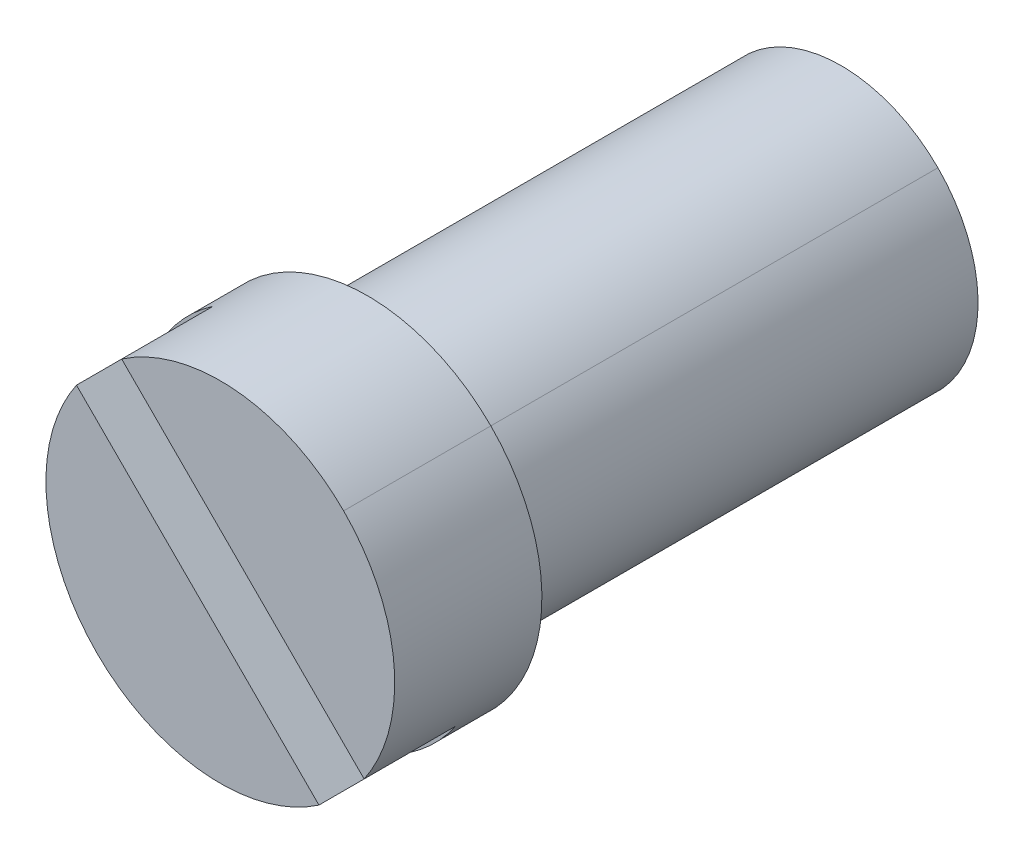
ISO-10303-21;
HEADER;
FILE_DESCRIPTION(('STEP AP214'),'2;1');
FILE_NAME('part.step','',(''),(''),'','','');
FILE_SCHEMA(('AUTOMOTIVE_DESIGN { 1 0 10303 214 1 1 1 1 }'));
ENDSEC;
DATA;
#1=APPLICATION_CONTEXT('core data for automotive mechanical design processes');
#2=APPLICATION_PROTOCOL_DEFINITION('international standard','automotive_design',2000,#1);
#3=PRODUCT_CONTEXT('',#1,'mechanical');
#4=PRODUCT('Part','Part','',(#3));
#5=PRODUCT_RELATED_PRODUCT_CATEGORY('part','',(#4));
#6=PRODUCT_DEFINITION_FORMATION('','',#4);
#7=PRODUCT_DEFINITION_CONTEXT('part definition',#1,'design');
#8=PRODUCT_DEFINITION('design','',#6,#7);
#9=PRODUCT_DEFINITION_SHAPE('','',#8);
#10=(LENGTH_UNIT() NAMED_UNIT(*) SI_UNIT(.MILLI.,.METRE.));
#11=(NAMED_UNIT(*) PLANE_ANGLE_UNIT() SI_UNIT($,.RADIAN.));
#12=(NAMED_UNIT(*) SI_UNIT($,.STERADIAN.) SOLID_ANGLE_UNIT());
#13=UNCERTAINTY_MEASURE_WITH_UNIT(LENGTH_MEASURE(1.E-05),#10,'distance_accuracy_value','');
#14=(GEOMETRIC_REPRESENTATION_CONTEXT(3) GLOBAL_UNCERTAINTY_ASSIGNED_CONTEXT((#13)) GLOBAL_UNIT_ASSIGNED_CONTEXT((#10,
#11,#12)) REPRESENTATION_CONTEXT('',''));
#15=CARTESIAN_POINT('',(0.,0.,0.));
#16=DIRECTION('',(0.,0.,1.));
#17=DIRECTION('',(1.,0.,0.));
#18=AXIS2_PLACEMENT_3D('',#15,#16,#17);
#19=CARTESIAN_POINT('',(12.700343805971,5.27034380597093,8.76943375672969));
#20=DIRECTION('',(0.,0.,1.));
#21=DIRECTION('',(0.707106781186547,0.707106781186548,0.));
#22=AXIS2_PLACEMENT_3D('',#19,#20,#21);
#23=CYLINDRICAL_SURFACE('',#22,1.5);
#24=DIRECTION('',(0.,0.,-1.));
#25=VECTOR('',#24,1.);
#26=CARTESIAN_POINT('',(13.7610039777508,6.33100397775075,8.76943375672969));
#27=LINE('',#26,#25);
#28=CARTESIAN_POINT('',(13.7610039777508,6.33100397775075,12.0176388374866));
#29=VERTEX_POINT('',#28);
#30=CARTESIAN_POINT('',(13.7610039777508,6.33100397775075,6.83));
#31=VERTEX_POINT('',#30);
#32=EDGE_CURVE('E28',#29,#31,#27,.T.);
#33=ORIENTED_EDGE('',*,*,#32,.F.);
#34=CARTESIAN_POINT('',(12.700343805971,5.27034380597093,12.0176388374866));
#35=DIRECTION('',(0.,0.,-1.));
#36=DIRECTION('',(0.707106781186547,0.707106781186548,0.));
#37=AXIS2_PLACEMENT_3D('',#34,#35,#36);
#38=CIRCLE('',#37,1.5);
#39=CARTESIAN_POINT('',(11.6396836341912,4.20968363419111,12.0176388374866));
#40=VERTEX_POINT('',#39);
#41=EDGE_CURVE('E175',#29,#40,#38,.T.);
#42=ORIENTED_EDGE('',*,*,#41,.T.);
#43=DIRECTION('',(0.,0.,-1.));
#44=VECTOR('',#43,1.);
#45=CARTESIAN_POINT('',(11.6396836341912,4.20968363419111,8.76943375672969));
#46=LINE('',#45,#44);
#47=CARTESIAN_POINT('',(11.6396836341912,4.20968363419111,6.83));
#48=VERTEX_POINT('',#47);
#49=EDGE_CURVE('E157',#40,#48,#46,.T.);
#50=ORIENTED_EDGE('',*,*,#49,.T.);
#51=CARTESIAN_POINT('',(12.700343805971,5.27034380597093,6.83));
#52=DIRECTION('',(0.,0.,-1.));
#53=DIRECTION('',(0.707106781186547,0.707106781186548,0.));
#54=AXIS2_PLACEMENT_3D('',#51,#52,#53);
#55=CIRCLE('',#54,1.5);
#56=EDGE_CURVE('E153',#31,#48,#55,.T.);
#57=ORIENTED_EDGE('',*,*,#56,.F.);
#58=EDGE_LOOP('',(#33,#42,#50,#57));
#59=FACE_BOUND('',#58,.T.);
#60=ADVANCED_FACE('F17',(#59),#23,.T.);
#61=CARTESIAN_POINT('',(12.700343805971,5.27034380597093,12.8238194187433));
#62=DIRECTION('',(0.,0.,-1.));
#63=DIRECTION('',(0.707106781186545,0.70710678118655,0.));
#64=AXIS2_PLACEMENT_3D('',#61,#62,#63);
#65=CYLINDRICAL_SURFACE('',#64,1.91034380597093);
#66=DIRECTION('',(0.,0.,1.));
#67=VECTOR('',#66,1.);
#68=CARTESIAN_POINT('',(11.3495267463712,3.91952674637119,12.8238194187433));
#69=LINE('',#68,#67);
#70=CARTESIAN_POINT('',(11.3495267463712,3.91952674637119,12.0176388374866));
#71=VERTEX_POINT('',#70);
#72=CARTESIAN_POINT('',(11.3495267463712,3.91952674637119,13.63));
#73=VERTEX_POINT('',#72);
#74=EDGE_CURVE('E158',#71,#73,#69,.T.);
#75=ORIENTED_EDGE('',*,*,#74,.T.);
#76=CARTESIAN_POINT('',(12.700343805971,5.27034380597093,13.63));
#77=DIRECTION('',(0.,0.,1.));
#78=DIRECTION('',(0.707106781186545,0.70710678118655,0.));
#79=AXIS2_PLACEMENT_3D('',#76,#77,#78);
#80=CIRCLE('',#79,1.91034380597093);
#81=CARTESIAN_POINT('',(11.1249043519045,6.35080851320685,13.63));
#82=VERTEX_POINT('',#81);
#83=EDGE_CURVE('E154',#82,#73,#80,.T.);
#84=ORIENTED_EDGE('',*,*,#83,.F.);
#85=DIRECTION('',(0.,0.,1.));
#86=VECTOR('',#85,1.);
#87=CARTESIAN_POINT('',(11.1249043519045,6.35080851320685,12.8238194187433));
#88=LINE('',#87,#86);
#89=CARTESIAN_POINT('',(11.1249043519045,6.35080851320685,12.63));
#90=VERTEX_POINT('',#89);
#91=EDGE_CURVE('E183',#90,#82,#88,.T.);
#92=ORIENTED_EDGE('',*,*,#91,.F.);
#93=CARTESIAN_POINT('',(12.700343805971,5.27034380597093,12.63));
#94=DIRECTION('',(0.,0.,1.));
#95=DIRECTION('',(0.707106781186545,0.70710678118655,0.));
#96=AXIS2_PLACEMENT_3D('',#93,#94,#95);
#97=CIRCLE('',#96,1.91034380597093);
#98=CARTESIAN_POINT('',(11.6198790987351,6.84578326003743,12.63));
#99=VERTEX_POINT('',#98);
#100=EDGE_CURVE('E100',#99,#90,#97,.T.);
#101=ORIENTED_EDGE('',*,*,#100,.F.);
#102=DIRECTION('',(0.,0.,1.));
#103=VECTOR('',#102,1.);
#104=CARTESIAN_POINT('',(11.6198790987351,6.84578326003743,12.8238194187433));
#105=LINE('',#104,#103);
#106=CARTESIAN_POINT('',(11.6198790987351,6.84578326003743,13.63));
#107=VERTEX_POINT('',#106);
#108=EDGE_CURVE('E125',#99,#107,#105,.T.);
#109=ORIENTED_EDGE('',*,*,#108,.T.);
#110=CARTESIAN_POINT('',(12.700343805971,5.27034380597093,13.63));
#111=DIRECTION('',(0.,0.,1.));
#112=DIRECTION('',(0.707106781186545,0.70710678118655,0.));
#113=AXIS2_PLACEMENT_3D('',#110,#111,#112);
#114=CIRCLE('',#113,1.91034380597093);
#115=CARTESIAN_POINT('',(14.0511608655707,6.62116086557068,13.63));
#116=VERTEX_POINT('',#115);
#117=EDGE_CURVE('E11',#116,#107,#114,.T.);
#118=ORIENTED_EDGE('',*,*,#117,.F.);
#119=DIRECTION('',(0.,0.,1.));
#120=VECTOR('',#119,1.);
#121=CARTESIAN_POINT('',(14.0511608655707,6.62116086557068,12.8238194187433));
#122=LINE('',#121,#120);
#123=CARTESIAN_POINT('',(14.0511608655707,6.62116086557068,12.0176388374866));
#124=VERTEX_POINT('',#123);
#125=EDGE_CURVE('E122',#124,#116,#122,.T.);
#126=ORIENTED_EDGE('',*,*,#125,.F.);
#127=CARTESIAN_POINT('',(12.700343805971,5.27034380597093,12.0176388374866));
#128=DIRECTION('',(0.,0.,-1.));
#129=DIRECTION('',(0.70710678118655,-0.707106781186545,0.));
#130=AXIS2_PLACEMENT_3D('',#127,#128,#129);
#131=CIRCLE('',#130,1.91034380597093);
#132=EDGE_CURVE('E66',#71,#124,#131,.T.);
#133=ORIENTED_EDGE('',*,*,#132,.F.);
#134=EDGE_LOOP('',(#75,#84,#92,#101,#109,#118,#126,#133));
#135=FACE_BOUND('',#134,.T.);
#136=ADVANCED_FACE('F19',(#135),#65,.T.);
#137=CARTESIAN_POINT('',(13.8022202938885,4.16846731805341,13.63));
#138=DIRECTION('',(0.,0.,-1.));
#139=DIRECTION('',(0.,-1.,0.));
#140=AXIS2_PLACEMENT_3D('',#137,#138,#139);
#141=PLANE('',#140);
#142=DIRECTION('',(-0.707106781186548,0.707106781186547,0.));
#143=VECTOR('',#142,1.);
#144=CARTESIAN_POINT('',(12.9478311793863,5.51783117938623,13.63));
#145=LINE('',#144,#143);
#146=CARTESIAN_POINT('',(14.2757832600374,4.1898790987351,13.63));
#147=VERTEX_POINT('',#146);
#148=EDGE_CURVE('E131',#147,#107,#145,.T.);
#149=ORIENTED_EDGE('',*,*,#148,.F.);
#150=CARTESIAN_POINT('',(12.700343805971,5.27034380597093,13.63));
#151=DIRECTION('',(0.,0.,1.));
#152=DIRECTION('',(0.707106781186545,0.70710678118655,0.));
#153=AXIS2_PLACEMENT_3D('',#150,#151,#152);
#154=CIRCLE('',#153,1.91034380597093);
#155=EDGE_CURVE('E129',#147,#116,#154,.T.);
#156=ORIENTED_EDGE('',*,*,#155,.T.);
#157=ORIENTED_EDGE('',*,*,#117,.T.);
#158=EDGE_LOOP('',(#149,#156,#157));
#159=FACE_BOUND('',#158,.T.);
#160=ADVANCED_FACE('F130',(#159),#141,.F.);
#161=CARTESIAN_POINT('',(12.700343805971,5.27034380597093,8.76943375672969));
#162=DIRECTION('',(0.,0.,1.));
#163=DIRECTION('',(0.707106781186547,0.707106781186548,0.));
#164=AXIS2_PLACEMENT_3D('',#161,#162,#163);
#165=CYLINDRICAL_SURFACE('',#164,1.5);
#166=CARTESIAN_POINT('',(12.700343805971,5.27034380597093,6.83));
#167=DIRECTION('',(0.,0.,-1.));
#168=DIRECTION('',(0.707106781186547,0.707106781186548,0.));
#169=AXIS2_PLACEMENT_3D('',#166,#167,#168);
#170=CIRCLE('',#169,1.5);
#171=EDGE_CURVE('E149',#48,#31,#170,.T.);
#172=ORIENTED_EDGE('',*,*,#171,.F.);
#173=ORIENTED_EDGE('',*,*,#49,.F.);
#174=CARTESIAN_POINT('',(12.700343805971,5.27034380597093,12.0176388374866));
#175=DIRECTION('',(0.,0.,-1.));
#176=DIRECTION('',(0.707106781186547,0.707106781186548,0.));
#177=AXIS2_PLACEMENT_3D('',#174,#175,#176);
#178=CIRCLE('',#177,1.5);
#179=EDGE_CURVE('E147',#40,#29,#178,.T.);
#180=ORIENTED_EDGE('',*,*,#179,.T.);
#181=ORIENTED_EDGE('',*,*,#32,.T.);
#182=EDGE_LOOP('',(#172,#173,#180,#181));
#183=FACE_BOUND('',#182,.T.);
#184=ADVANCED_FACE('F201',(#183),#165,.T.);
#185=CARTESIAN_POINT('',(11.3356260212247,7.13003633754783,12.63));
#186=DIRECTION('',(0.,0.,-1.));
#187=DIRECTION('',(0.,-1.,0.));
#188=AXIS2_PLACEMENT_3D('',#185,#186,#187);
#189=PLANE('',#188);
#190=DIRECTION('',(-0.707106781186548,0.707106781186547,0.));
#191=VECTOR('',#190,1.);
#192=CARTESIAN_POINT('',(12.9478311793863,5.51783117938623,12.63));
#193=LINE('',#192,#191);
#194=CARTESIAN_POINT('',(14.2757832600374,4.1898790987351,12.63));
#195=VERTEX_POINT('',#194);
#196=EDGE_CURVE('E163',#195,#99,#193,.T.);
#197=ORIENTED_EDGE('',*,*,#196,.T.);
#198=ORIENTED_EDGE('',*,*,#100,.T.);
#199=DIRECTION('',(0.707106781186548,-0.707106781186547,0.));
#200=VECTOR('',#199,1.);
#201=CARTESIAN_POINT('',(12.4528564325557,5.02285643255565,12.63));
#202=LINE('',#201,#200);
#203=CARTESIAN_POINT('',(13.7808085132068,3.69490435190452,12.63));
#204=VERTEX_POINT('',#203);
#205=EDGE_CURVE('E180',#90,#204,#202,.T.);
#206=ORIENTED_EDGE('',*,*,#205,.T.);
#207=CARTESIAN_POINT('',(12.700343805971,5.27034380597093,12.63));
#208=DIRECTION('',(0.,0.,1.));
#209=DIRECTION('',(0.707106781186545,0.70710678118655,0.));
#210=AXIS2_PLACEMENT_3D('',#207,#208,#209);
#211=CIRCLE('',#210,1.91034380597093);
#212=EDGE_CURVE('E108',#204,#195,#211,.T.);
#213=ORIENTED_EDGE('',*,*,#212,.T.);
#214=EDGE_LOOP('',(#197,#198,#206,#213));
#215=FACE_BOUND('',#214,.T.);
#216=ADVANCED_FACE('F275',(#215),#189,.F.);
#217=CARTESIAN_POINT('',(12.3025962415535,4.8725962415535,6.83));
#218=DIRECTION('',(0.,0.,1.));
#219=DIRECTION('',(0.,-1.,0.));
#220=AXIS2_PLACEMENT_3D('',#217,#218,#219);
#221=PLANE('',#220);
#222=ORIENTED_EDGE('',*,*,#171,.T.);
#223=ORIENTED_EDGE('',*,*,#56,.T.);
#224=EDGE_LOOP('',(#222,#223));
#225=FACE_BOUND('',#224,.T.);
#226=ADVANCED_FACE('F198',(#225),#221,.F.);
#227=CARTESIAN_POINT('',(13.8022202938885,4.16846731805341,13.63));
#228=DIRECTION('',(0.,0.,-1.));
#229=DIRECTION('',(0.,-1.,0.));
#230=AXIS2_PLACEMENT_3D('',#227,#228,#229);
#231=PLANE('',#230);
#232=CARTESIAN_POINT('',(12.700343805971,5.27034380597093,13.63));
#233=DIRECTION('',(0.,0.,1.));
#234=DIRECTION('',(0.707106781186545,0.70710678118655,0.));
#235=AXIS2_PLACEMENT_3D('',#232,#233,#234);
#236=CIRCLE('',#235,1.91034380597093);
#237=CARTESIAN_POINT('',(13.7808085132068,3.69490435190452,13.63));
#238=VERTEX_POINT('',#237);
#239=EDGE_CURVE('E79',#73,#238,#236,.T.);
#240=ORIENTED_EDGE('',*,*,#239,.T.);
#241=DIRECTION('',(0.707106781186548,-0.707106781186547,0.));
#242=VECTOR('',#241,1.);
#243=CARTESIAN_POINT('',(12.4528564325557,5.02285643255565,13.63));
#244=LINE('',#243,#242);
#245=EDGE_CURVE('E190',#82,#238,#244,.T.);
#246=ORIENTED_EDGE('',*,*,#245,.F.);
#247=ORIENTED_EDGE('',*,*,#83,.T.);
#248=EDGE_LOOP('',(#240,#246,#247));
#249=FACE_BOUND('',#248,.T.);
#250=ADVANCED_FACE('F265',(#249),#231,.F.);
#251=CARTESIAN_POINT('',(13.865585149397,4.10510246254486,12.0176388374866));
#252=DIRECTION('',(0.,0.,1.));
#253=DIRECTION('',(0.,-1.,0.));
#254=AXIS2_PLACEMENT_3D('',#251,#252,#253);
#255=PLANE('',#254);
#256=ORIENTED_EDGE('',*,*,#179,.F.);
#257=ORIENTED_EDGE('',*,*,#41,.F.);
#258=EDGE_LOOP('',(#256,#257));
#259=FACE_BOUND('',#258,.T.);
#260=CARTESIAN_POINT('',(12.700343805971,5.27034380597093,12.0176388374866));
#261=DIRECTION('',(0.,0.,-1.));
#262=DIRECTION('',(0.70710678118655,-0.707106781186545,0.));
#263=AXIS2_PLACEMENT_3D('',#260,#261,#262);
#264=CIRCLE('',#263,1.91034380597093);
#265=EDGE_CURVE('E21',#124,#71,#264,.T.);
#266=ORIENTED_EDGE('',*,*,#265,.T.);
#267=ORIENTED_EDGE('',*,*,#132,.T.);
#268=EDGE_LOOP('',(#266,#267));
#269=FACE_BOUND('',#268,.T.);
#270=ADVANCED_FACE('F205',(#259,#269),#255,.F.);
#271=CARTESIAN_POINT('',(12.700343805971,5.27034380597093,12.8238194187433));
#272=DIRECTION('',(0.,0.,-1.));
#273=DIRECTION('',(0.707106781186545,0.70710678118655,0.));
#274=AXIS2_PLACEMENT_3D('',#271,#272,#273);
#275=CYLINDRICAL_SURFACE('',#274,1.91034380597093);
#276=ORIENTED_EDGE('',*,*,#265,.F.);
#277=ORIENTED_EDGE('',*,*,#125,.T.);
#278=ORIENTED_EDGE('',*,*,#155,.F.);
#279=DIRECTION('',(0.,0.,1.));
#280=VECTOR('',#279,1.);
#281=CARTESIAN_POINT('',(14.2757832600374,4.1898790987351,12.8238194187433));
#282=LINE('',#281,#280);
#283=EDGE_CURVE('E166',#195,#147,#282,.T.);
#284=ORIENTED_EDGE('',*,*,#283,.F.);
#285=ORIENTED_EDGE('',*,*,#212,.F.);
#286=DIRECTION('',(0.,0.,1.));
#287=VECTOR('',#286,1.);
#288=CARTESIAN_POINT('',(13.7808085132068,3.69490435190452,12.8238194187433));
#289=LINE('',#288,#287);
#290=EDGE_CURVE('E144',#204,#238,#289,.T.);
#291=ORIENTED_EDGE('',*,*,#290,.T.);
#292=ORIENTED_EDGE('',*,*,#239,.F.);
#293=ORIENTED_EDGE('',*,*,#74,.F.);
#294=EDGE_LOOP('',(#276,#277,#278,#284,#285,#291,#292,#293));
#295=FACE_BOUND('',#294,.T.);
#296=ADVANCED_FACE('F136',(#295),#275,.T.);
#297=CARTESIAN_POINT('',(10.8406512743941,6.63506159071725,12.63));
#298=DIRECTION('',(-0.707106781186547,-0.707106781186548,0.));
#299=DIRECTION('',(-0.707106781186548,0.707106781186547,0.));
#300=AXIS2_PLACEMENT_3D('',#297,#298,#299);
#301=PLANE('',#300);
#302=ORIENTED_EDGE('',*,*,#205,.F.);
#303=ORIENTED_EDGE('',*,*,#91,.T.);
#304=ORIENTED_EDGE('',*,*,#245,.T.);
#305=ORIENTED_EDGE('',*,*,#290,.F.);
#306=EDGE_LOOP('',(#302,#303,#304,#305));
#307=FACE_BOUND('',#306,.T.);
#308=ADVANCED_FACE('F285',(#307),#301,.F.);
#309=CARTESIAN_POINT('',(11.3356260212247,7.13003633754783,14.515608753973));
#310=DIRECTION('',(0.707106781186547,0.707106781186548,0.));
#311=DIRECTION('',(0.,0.,-1.));
#312=AXIS2_PLACEMENT_3D('',#309,#310,#311);
#313=PLANE('',#312);
#314=ORIENTED_EDGE('',*,*,#148,.T.);
#315=ORIENTED_EDGE('',*,*,#108,.F.);
#316=ORIENTED_EDGE('',*,*,#196,.F.);
#317=ORIENTED_EDGE('',*,*,#283,.T.);
#318=EDGE_LOOP('',(#314,#315,#316,#317));
#319=FACE_BOUND('',#318,.T.);
#320=ADVANCED_FACE('F281',(#319),#313,.F.);
#321=CLOSED_SHELL('',(#60,#136,#160,#184,#216,#226,#250,#270,#296,#308,#320));
#322=MANIFOLD_SOLID_BREP('B1',#321);
#323=ADVANCED_BREP_SHAPE_REPRESENTATION('',(#18,#322),#14);
#324=SHAPE_DEFINITION_REPRESENTATION(#9,#323);
ENDSEC;
END-ISO-10303-21;
